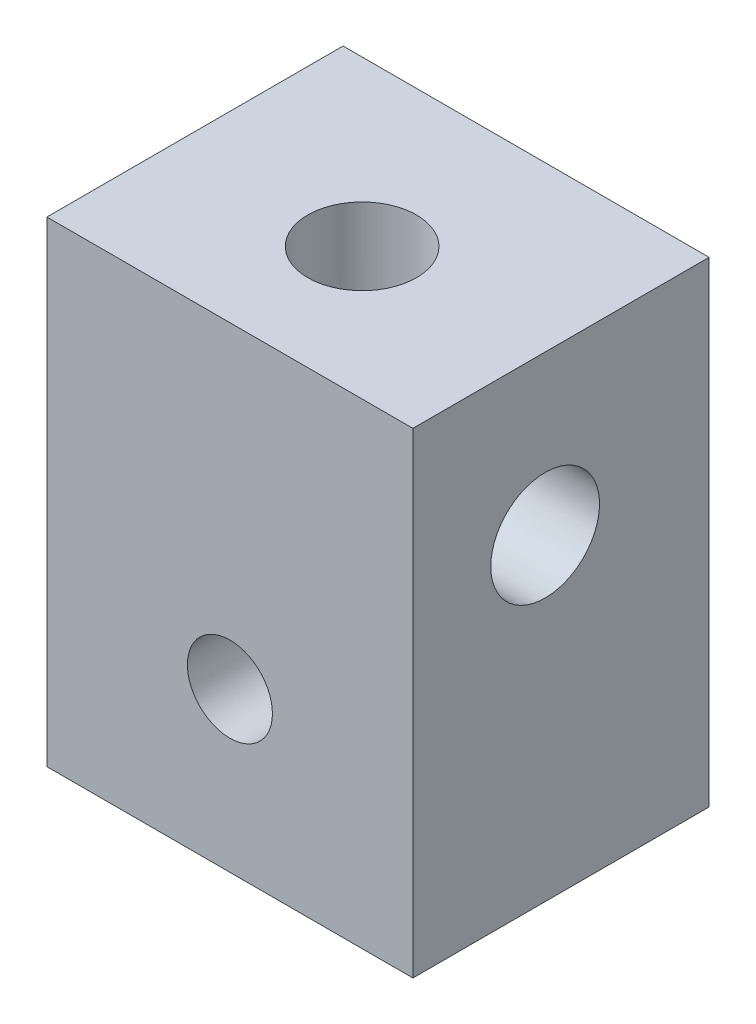
ISO-10303-21;
HEADER;
FILE_DESCRIPTION(('STEP AP214'),'2;1');
FILE_NAME('part.step','',(''),(''),'','','');
FILE_SCHEMA(('AUTOMOTIVE_DESIGN { 1 0 10303 214 1 1 1 1 }'));
ENDSEC;
DATA;
#1=APPLICATION_CONTEXT('core data for automotive mechanical design processes');
#2=APPLICATION_PROTOCOL_DEFINITION('international standard','automotive_design',2000,#1);
#3=PRODUCT_CONTEXT('',#1,'mechanical');
#4=PRODUCT('Part','Part','',(#3));
#5=PRODUCT_RELATED_PRODUCT_CATEGORY('part','',(#4));
#6=PRODUCT_DEFINITION_FORMATION('','',#4);
#7=PRODUCT_DEFINITION_CONTEXT('part definition',#1,'design');
#8=PRODUCT_DEFINITION('design','',#6,#7);
#9=PRODUCT_DEFINITION_SHAPE('','',#8);
#10=(LENGTH_UNIT() NAMED_UNIT(*) SI_UNIT(.MILLI.,.METRE.));
#11=(NAMED_UNIT(*) PLANE_ANGLE_UNIT() SI_UNIT($,.RADIAN.));
#12=(NAMED_UNIT(*) SI_UNIT($,.STERADIAN.) SOLID_ANGLE_UNIT());
#13=UNCERTAINTY_MEASURE_WITH_UNIT(LENGTH_MEASURE(1.E-05),#10,'distance_accuracy_value','');
#14=(GEOMETRIC_REPRESENTATION_CONTEXT(3) GLOBAL_UNCERTAINTY_ASSIGNED_CONTEXT((#13)) GLOBAL_UNIT_ASSIGNED_CONTEXT((#10,
#11,#12)) REPRESENTATION_CONTEXT('',''));
#15=CARTESIAN_POINT('',(0.,0.,0.));
#16=DIRECTION('',(0.,0.,1.));
#17=DIRECTION('',(1.,0.,0.));
#18=AXIS2_PLACEMENT_3D('',#15,#16,#17);
#19=CARTESIAN_POINT('',(0.,-28.575,0.));
#20=DIRECTION('',(-1.,0.,0.));
#21=DIRECTION('',(0.,0.,1.));
#22=AXIS2_PLACEMENT_3D('',#19,#20,#21);
#23=PLANE('',#22);
#24=CARTESIAN_POINT('',(0.,-9.52500000000001,-7.9375));
#25=DIRECTION('',(-1.,0.,0.));
#26=DIRECTION('',(0.,0.,1.));
#27=AXIS2_PLACEMENT_3D('',#24,#25,#26);
#28=CIRCLE('',#27,3.2639);
#29=CARTESIAN_POINT('',(0.,-9.52500000000001,-4.67360000000001));
#30=VERTEX_POINT('',#29);
#31=EDGE_CURVE('E121',#30,#30,#28,.T.);
#32=ORIENTED_EDGE('',*,*,#31,.F.);
#33=EDGE_LOOP('',(#32));
#34=FACE_BOUND('',#33,.T.);
#35=DIRECTION('',(0.,0.,1.));
#36=VECTOR('',#35,1.);
#37=CARTESIAN_POINT('',(0.,0.,0.));
#38=LINE('',#37,#36);
#39=CARTESIAN_POINT('',(0.,0.,-17.78));
#40=VERTEX_POINT('',#39);
#41=CARTESIAN_POINT('',(0.,0.,0.));
#42=VERTEX_POINT('',#41);
#43=EDGE_CURVE('E141',#40,#42,#38,.T.);
#44=ORIENTED_EDGE('',*,*,#43,.F.);
#45=DIRECTION('',(0.,1.,0.));
#46=VECTOR('',#45,1.);
#47=CARTESIAN_POINT('',(0.,-28.575,-17.78));
#48=LINE('',#47,#46);
#49=CARTESIAN_POINT('',(0.,-28.575,-17.78));
#50=VERTEX_POINT('',#49);
#51=EDGE_CURVE('E75',#50,#40,#48,.T.);
#52=ORIENTED_EDGE('',*,*,#51,.F.);
#53=DIRECTION('',(0.,0.,1.));
#54=VECTOR('',#53,1.);
#55=CARTESIAN_POINT('',(0.,-28.575,0.));
#56=LINE('',#55,#54);
#57=CARTESIAN_POINT('',(0.,-28.575,0.));
#58=VERTEX_POINT('',#57);
#59=EDGE_CURVE('E142',#50,#58,#56,.T.);
#60=ORIENTED_EDGE('',*,*,#59,.T.);
#61=DIRECTION('',(0.,1.,0.));
#62=VECTOR('',#61,1.);
#63=CARTESIAN_POINT('',(0.,-28.575,0.));
#64=LINE('',#63,#62);
#65=EDGE_CURVE('E101',#58,#42,#64,.T.);
#66=ORIENTED_EDGE('',*,*,#65,.T.);
#67=EDGE_LOOP('',(#44,#52,#60,#66));
#68=FACE_BOUND('',#67,.T.);
#69=ADVANCED_FACE('F51',(#34,#68),#23,.T.);
#70=CARTESIAN_POINT('',(0.,-28.575,-17.78));
#71=DIRECTION('',(0.,0.,-1.));
#72=DIRECTION('',(-1.,0.,0.));
#73=AXIS2_PLACEMENT_3D('',#70,#71,#72);
#74=PLANE('',#73);
#75=CARTESIAN_POINT('',(10.9855,-19.05,-17.78));
#76=DIRECTION('',(0.,0.,1.));
#77=DIRECTION('',(1.,0.,0.));
#78=AXIS2_PLACEMENT_3D('',#75,#76,#77);
#79=CIRCLE('',#78,2.5527);
#80=CARTESIAN_POINT('',(13.5382,-19.05,-17.78));
#81=VERTEX_POINT('',#80);
#82=EDGE_CURVE('E137',#81,#81,#79,.T.);
#83=ORIENTED_EDGE('',*,*,#82,.T.);
#84=EDGE_LOOP('',(#83));
#85=FACE_BOUND('',#84,.T.);
#86=DIRECTION('',(-1.,0.,0.));
#87=VECTOR('',#86,1.);
#88=CARTESIAN_POINT('',(0.,0.,-17.78));
#89=LINE('',#88,#87);
#90=CARTESIAN_POINT('',(21.971,0.,-17.78));
#91=VERTEX_POINT('',#90);
#92=EDGE_CURVE('E146',#91,#40,#89,.T.);
#93=ORIENTED_EDGE('',*,*,#92,.F.);
#94=DIRECTION('',(0.,1.,0.));
#95=VECTOR('',#94,1.);
#96=CARTESIAN_POINT('',(21.971,-28.575,-17.78));
#97=LINE('',#96,#95);
#98=CARTESIAN_POINT('',(21.971,-28.575,-17.78));
#99=VERTEX_POINT('',#98);
#100=EDGE_CURVE('E172',#99,#91,#97,.T.);
#101=ORIENTED_EDGE('',*,*,#100,.F.);
#102=DIRECTION('',(-1.,0.,0.));
#103=VECTOR('',#102,1.);
#104=CARTESIAN_POINT('',(0.,-28.575,-17.78));
#105=LINE('',#104,#103);
#106=EDGE_CURVE('E153',#99,#50,#105,.T.);
#107=ORIENTED_EDGE('',*,*,#106,.T.);
#108=ORIENTED_EDGE('',*,*,#51,.T.);
#109=EDGE_LOOP('',(#93,#101,#107,#108));
#110=FACE_BOUND('',#109,.T.);
#111=ADVANCED_FACE('F184',(#85,#110),#74,.T.);
#112=CARTESIAN_POINT('',(21.971,-28.575,0.));
#113=DIRECTION('',(1.,0.,0.));
#114=DIRECTION('',(0.,0.,-1.));
#115=AXIS2_PLACEMENT_3D('',#112,#113,#114);
#116=PLANE('',#115);
#117=CARTESIAN_POINT('',(21.971,-9.52500000000001,-7.9375));
#118=DIRECTION('',(-1.,0.,0.));
#119=DIRECTION('',(0.,0.,1.));
#120=AXIS2_PLACEMENT_3D('',#117,#118,#119);
#121=CIRCLE('',#120,3.2639);
#122=CARTESIAN_POINT('',(21.971,-9.52500000000001,-4.67360000000001));
#123=VERTEX_POINT('',#122);
#124=EDGE_CURVE('E118',#123,#123,#121,.T.);
#125=ORIENTED_EDGE('',*,*,#124,.T.);
#126=EDGE_LOOP('',(#125));
#127=FACE_BOUND('',#126,.T.);
#128=DIRECTION('',(0.,0.,-1.));
#129=VECTOR('',#128,1.);
#130=CARTESIAN_POINT('',(21.971,0.,0.));
#131=LINE('',#130,#129);
#132=CARTESIAN_POINT('',(21.971,0.,0.));
#133=VERTEX_POINT('',#132);
#134=EDGE_CURVE('E163',#133,#91,#131,.T.);
#135=ORIENTED_EDGE('',*,*,#134,.F.);
#136=DIRECTION('',(0.,1.,0.));
#137=VECTOR('',#136,1.);
#138=CARTESIAN_POINT('',(21.971,-28.575,0.));
#139=LINE('',#138,#137);
#140=CARTESIAN_POINT('',(21.971,-28.575,0.));
#141=VERTEX_POINT('',#140);
#142=EDGE_CURVE('E175',#141,#133,#139,.T.);
#143=ORIENTED_EDGE('',*,*,#142,.F.);
#144=DIRECTION('',(0.,0.,-1.));
#145=VECTOR('',#144,1.);
#146=CARTESIAN_POINT('',(21.971,-28.575,0.));
#147=LINE('',#146,#145);
#148=EDGE_CURVE('E149',#141,#99,#147,.T.);
#149=ORIENTED_EDGE('',*,*,#148,.T.);
#150=ORIENTED_EDGE('',*,*,#100,.T.);
#151=EDGE_LOOP('',(#135,#143,#149,#150));
#152=FACE_BOUND('',#151,.T.);
#153=ADVANCED_FACE('F188',(#127,#152),#116,.T.);
#154=CARTESIAN_POINT('',(0.,-28.575,0.));
#155=DIRECTION('',(0.,0.,1.));
#156=DIRECTION('',(1.,0.,0.));
#157=AXIS2_PLACEMENT_3D('',#154,#155,#156);
#158=PLANE('',#157);
#159=CARTESIAN_POINT('',(10.9855,-19.05,0.));
#160=DIRECTION('',(0.,0.,1.));
#161=DIRECTION('',(1.,0.,0.));
#162=AXIS2_PLACEMENT_3D('',#159,#160,#161);
#163=CIRCLE('',#162,2.5527);
#164=CARTESIAN_POINT('',(13.5382,-19.05,0.));
#165=VERTEX_POINT('',#164);
#166=EDGE_CURVE('E129',#165,#165,#163,.T.);
#167=ORIENTED_EDGE('',*,*,#166,.F.);
#168=EDGE_LOOP('',(#167));
#169=FACE_BOUND('',#168,.T.);
#170=DIRECTION('',(1.,0.,0.));
#171=VECTOR('',#170,1.);
#172=CARTESIAN_POINT('',(0.,0.,0.));
#173=LINE('',#172,#171);
#174=EDGE_CURVE('E159',#42,#133,#173,.T.);
#175=ORIENTED_EDGE('',*,*,#174,.F.);
#176=ORIENTED_EDGE('',*,*,#65,.F.);
#177=DIRECTION('',(1.,0.,0.));
#178=VECTOR('',#177,1.);
#179=CARTESIAN_POINT('',(0.,-28.575,0.));
#180=LINE('',#179,#178);
#181=EDGE_CURVE('E145',#58,#141,#180,.T.);
#182=ORIENTED_EDGE('',*,*,#181,.T.);
#183=ORIENTED_EDGE('',*,*,#142,.T.);
#184=EDGE_LOOP('',(#175,#176,#182,#183));
#185=FACE_BOUND('',#184,.T.);
#186=ADVANCED_FACE('F180',(#169,#185),#158,.T.);
#187=CARTESIAN_POINT('',(0.,-28.575,0.));
#188=DIRECTION('',(0.,-1.,0.));
#189=DIRECTION('',(0.,0.,-1.));
#190=AXIS2_PLACEMENT_3D('',#187,#188,#189);
#191=PLANE('',#190);
#192=ORIENTED_EDGE('',*,*,#59,.F.);
#193=ORIENTED_EDGE('',*,*,#106,.F.);
#194=ORIENTED_EDGE('',*,*,#148,.F.);
#195=ORIENTED_EDGE('',*,*,#181,.F.);
#196=EDGE_LOOP('',(#192,#193,#194,#195));
#197=FACE_BOUND('',#196,.T.);
#198=ADVANCED_FACE('F190',(#197),#191,.T.);
#199=CARTESIAN_POINT('',(0.,0.,0.));
#200=DIRECTION('',(0.,-1.,0.));
#201=DIRECTION('',(0.,0.,-1.));
#202=AXIS2_PLACEMENT_3D('',#199,#200,#201);
#203=PLANE('',#202);
#204=CARTESIAN_POINT('',(10.9855,0.,-7.9375));
#205=DIRECTION('',(0.,1.,0.));
#206=DIRECTION('',(0.,0.,1.));
#207=AXIS2_PLACEMENT_3D('',#204,#205,#206);
#208=CIRCLE('',#207,3.2639);
#209=CARTESIAN_POINT('',(10.9855,0.,-4.6736));
#210=VERTEX_POINT('',#209);
#211=EDGE_CURVE('E124',#210,#210,#208,.T.);
#212=ORIENTED_EDGE('',*,*,#211,.F.);
#213=EDGE_LOOP('',(#212));
#214=FACE_BOUND('',#213,.T.);
#215=ORIENTED_EDGE('',*,*,#43,.T.);
#216=ORIENTED_EDGE('',*,*,#174,.T.);
#217=ORIENTED_EDGE('',*,*,#134,.T.);
#218=ORIENTED_EDGE('',*,*,#92,.T.);
#219=EDGE_LOOP('',(#215,#216,#217,#218));
#220=FACE_BOUND('',#219,.T.);
#221=ADVANCED_FACE('F183',(#214,#220),#203,.F.);
#222=CARTESIAN_POINT('',(10.9855,-19.05,0.));
#223=DIRECTION('',(0.,0.,1.));
#224=DIRECTION('',(1.,0.,0.));
#225=AXIS2_PLACEMENT_3D('',#222,#223,#224);
#226=CYLINDRICAL_SURFACE('',#225,2.5527);
#227=ORIENTED_EDGE('',*,*,#82,.F.);
#228=EDGE_LOOP('',(#227));
#229=FACE_BOUND('',#228,.T.);
#230=ORIENTED_EDGE('',*,*,#166,.T.);
#231=EDGE_LOOP('',(#230));
#232=FACE_BOUND('',#231,.T.);
#233=ADVANCED_FACE('F113',(#229,#232),#226,.F.);
#234=CARTESIAN_POINT('',(0.,-9.52500000000001,-7.9375));
#235=DIRECTION('',(-1.,0.,0.));
#236=DIRECTION('',(0.,0.,1.));
#237=AXIS2_PLACEMENT_3D('',#234,#235,#236);
#238=CYLINDRICAL_SURFACE('',#237,3.2639);
#239=CARTESIAN_POINT('',(10.9855,-9.52500000000001,-7.9375));
#240=DIRECTION('',(-0.707106781186547,-0.707106781186547,0.));
#241=DIRECTION('',(-0.707106781186547,0.707106781186547,0.));
#242=AXIS2_PLACEMENT_3D('',#239,#240,#241);
#243=ELLIPSE('',#242,4.61585164622954,3.2639);
#244=CARTESIAN_POINT('',(10.9855,-9.52500000000001,-11.2014));
#245=VERTEX_POINT('',#244);
#246=CARTESIAN_POINT('',(10.9855,-9.52500000000001,-4.6736));
#247=VERTEX_POINT('',#246);
#248=EDGE_CURVE('E59',#245,#247,#243,.F.);
#249=ORIENTED_EDGE('',*,*,#248,.T.);
#250=CARTESIAN_POINT('',(10.9855,-9.52500000000001,-7.9375));
#251=DIRECTION('',(-0.707106781186547,0.707106781186547,0.));
#252=DIRECTION('',(-0.707106781186547,-0.707106781186547,0.));
#253=AXIS2_PLACEMENT_3D('',#250,#251,#252);
#254=ELLIPSE('',#253,4.61585164622954,3.2639);
#255=EDGE_CURVE('E11',#247,#245,#254,.T.);
#256=ORIENTED_EDGE('',*,*,#255,.T.);
#257=EDGE_LOOP('',(#249,#256));
#258=FACE_BOUND('',#257,.T.);
#259=ORIENTED_EDGE('',*,*,#124,.F.);
#260=EDGE_LOOP('',(#259));
#261=FACE_BOUND('',#260,.T.);
#262=ORIENTED_EDGE('',*,*,#31,.T.);
#263=EDGE_LOOP('',(#262));
#264=FACE_BOUND('',#263,.T.);
#265=ADVANCED_FACE('F110',(#258,#261,#264),#238,.F.);
#266=CARTESIAN_POINT('',(10.9855,0.,-7.9375));
#267=DIRECTION('',(0.,1.,0.));
#268=DIRECTION('',(0.,0.,1.));
#269=AXIS2_PLACEMENT_3D('',#266,#267,#268);
#270=CYLINDRICAL_SURFACE('',#269,3.2639);
#271=ORIENTED_EDGE('',*,*,#248,.F.);
#272=ORIENTED_EDGE('',*,*,#255,.F.);
#273=EDGE_LOOP('',(#271,#272));
#274=FACE_BOUND('',#273,.T.);
#275=ORIENTED_EDGE('',*,*,#211,.T.);
#276=EDGE_LOOP('',(#275));
#277=FACE_BOUND('',#276,.T.);
#278=ADVANCED_FACE('F106',(#274,#277),#270,.F.);
#279=CLOSED_SHELL('',(#69,#111,#153,#186,#198,#221,#233,#265,#278));
#280=MANIFOLD_SOLID_BREP('B2',#279);
#281=ADVANCED_BREP_SHAPE_REPRESENTATION('',(#18,#280),#14);
#282=SHAPE_DEFINITION_REPRESENTATION(#9,#281);
ENDSEC;
END-ISO-10303-21;
